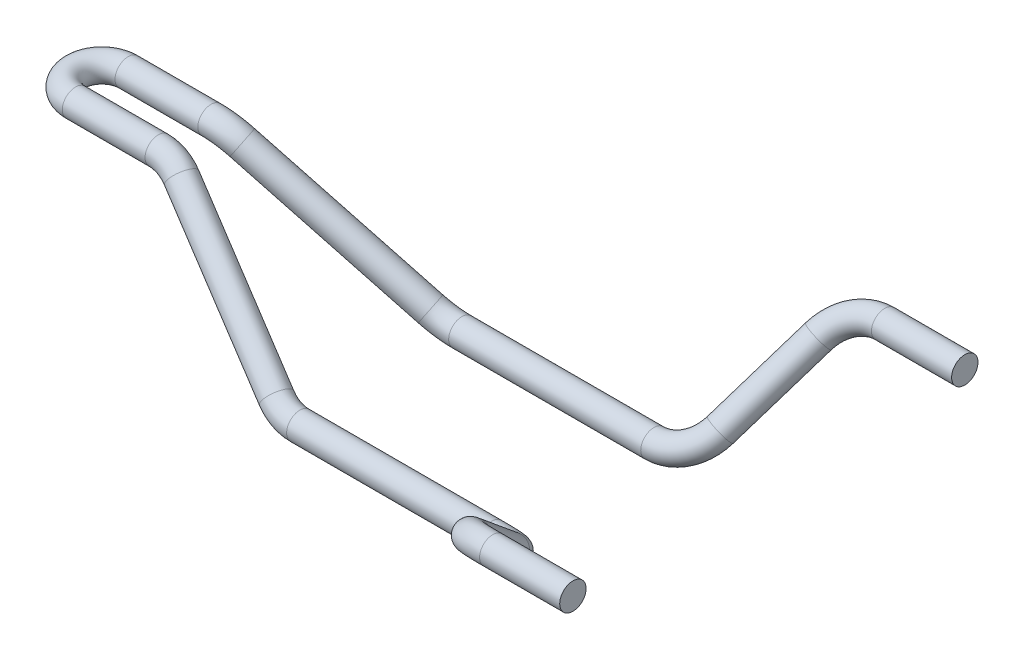
ISO-10303-21;
HEADER;
FILE_DESCRIPTION(('STEP AP214'),'2;1');
FILE_NAME('part.step','',(''),(''),'','','');
FILE_SCHEMA(('AUTOMOTIVE_DESIGN { 1 0 10303 214 1 1 1 1 }'));
ENDSEC;
DATA;
#1=APPLICATION_CONTEXT('core data for automotive mechanical design processes');
#2=APPLICATION_PROTOCOL_DEFINITION('international standard','automotive_design',2000,#1);
#3=PRODUCT_CONTEXT('',#1,'mechanical');
#4=PRODUCT('Part','Part','',(#3));
#5=PRODUCT_RELATED_PRODUCT_CATEGORY('part','',(#4));
#6=PRODUCT_DEFINITION_FORMATION('','',#4);
#7=PRODUCT_DEFINITION_CONTEXT('part definition',#1,'design');
#8=PRODUCT_DEFINITION('design','',#6,#7);
#9=PRODUCT_DEFINITION_SHAPE('','',#8);
#10=(LENGTH_UNIT() NAMED_UNIT(*) SI_UNIT(.MILLI.,.METRE.));
#11=(NAMED_UNIT(*) PLANE_ANGLE_UNIT() SI_UNIT($,.RADIAN.));
#12=(NAMED_UNIT(*) SI_UNIT($,.STERADIAN.) SOLID_ANGLE_UNIT());
#13=UNCERTAINTY_MEASURE_WITH_UNIT(LENGTH_MEASURE(1.E-05),#10,'distance_accuracy_value','');
#14=(GEOMETRIC_REPRESENTATION_CONTEXT(3) GLOBAL_UNCERTAINTY_ASSIGNED_CONTEXT((#13)) GLOBAL_UNIT_ASSIGNED_CONTEXT((#10,
#11,#12)) REPRESENTATION_CONTEXT('',''));
#15=CARTESIAN_POINT('',(0.,0.,0.));
#16=DIRECTION('',(0.,0.,1.));
#17=DIRECTION('',(1.,0.,0.));
#18=AXIS2_PLACEMENT_3D('',#15,#16,#17);
#19=CARTESIAN_POINT('',(155.73421721647,-2.49999999999997,-52.));
#20=DIRECTION('',(1.,0.,0.));
#21=DIRECTION('',(0.,1.,0.));
#22=AXIS2_PLACEMENT_3D('',#19,#20,#21);
#23=CYLINDRICAL_SURFACE('',#22,3.5);
#24=CARTESIAN_POINT('',(155.73421721647,-2.49999999999997,-52.));
#25=DIRECTION('',(-1.,0.,0.));
#26=DIRECTION('',(0.,0.,1.));
#27=AXIS2_PLACEMENT_3D('',#24,#25,#26);
#28=CIRCLE('',#27,3.5);
#29=CARTESIAN_POINT('',(155.73421721647,-0.156270073709799,-54.5994095546127));
#30=VERTEX_POINT('',#29);
#31=EDGE_CURVE('E30',#30,#30,#28,.T.);
#32=ORIENTED_EDGE('',*,*,#31,.F.);
#33=EDGE_LOOP('',(#32));
#34=FACE_BOUND('',#33,.T.);
#35=CARTESIAN_POINT('',(177.,-2.49999999999997,-52.));
#36=DIRECTION('',(-1.,0.,0.));
#37=DIRECTION('',(0.,0.,1.));
#38=AXIS2_PLACEMENT_3D('',#35,#36,#37);
#39=CIRCLE('',#38,3.5);
#40=CARTESIAN_POINT('',(177.,-2.49999999999997,-48.5));
#41=VERTEX_POINT('',#40);
#42=EDGE_CURVE('E10',#41,#41,#39,.T.);
#43=ORIENTED_EDGE('',*,*,#42,.T.);
#44=EDGE_LOOP('',(#43));
#45=FACE_BOUND('',#44,.T.);
#46=ADVANCED_FACE('F24',(#34,#45),#23,.T.);
#47=CARTESIAN_POINT('',(155.73421721647,-10.5356454615663,-43.0877386698992));
#48=DIRECTION('',(0.,-0.742688444175064,-0.669637121797189));
#49=DIRECTION('',(0.,0.669637121797189,-0.742688444175064));
#50=AXIS2_PLACEMENT_3D('',#47,#48,#49);
#51=TOROIDAL_SURFACE('',#50,12.,3.5);
#52=CARTESIAN_POINT('',(144.315206142244,-8.06558420208298,-45.8272611576897));
#53=DIRECTION('',(-0.307388033891904,-0.637216142459563,0.706730630727878));
#54=DIRECTION('',(0.706730630727878,0.344457922664195,0.617964849408802));
#55=AXIS2_PLACEMENT_3D('',#52,#53,#54);
#56=CIRCLE('',#55,3.5);
#57=CARTESIAN_POINT('',(140.984661245595,-7.34514966806703,-46.626288549962));
#58=VERTEX_POINT('',#57);
#59=EDGE_CURVE('E34',#58,#58,#56,.T.);
#60=CARTESIAN_POINT('',(155.73421721647,-10.5356454615663,-43.0877386698992));
#61=DIRECTION('',(0.,-0.742688444175064,-0.669637121797189));
#62=DIRECTION('',(0.,0.669637121797189,-0.742688444175064));
#63=AXIS2_PLACEMENT_3D('',#60,#61,#62);
#64=CIRCLE('',#63,15.5);
#65=EDGE_CURVE('',#58,#30,#64,.T.);
#66=ORIENTED_EDGE('',*,*,#59,.F.);
#67=ORIENTED_EDGE('',*,*,#31,.T.);
#68=ORIENTED_EDGE('',*,*,#65,.T.);
#69=ORIENTED_EDGE('',*,*,#65,.F.);
#70=EDGE_LOOP('',(#66,#68,#67,#69));
#71=FACE_BOUND('',#70,.T.);
#72=ADVANCED_FACE('F117',(#71),#51,.T.);
#73=CARTESIAN_POINT('',(136.419011074226,-24.434415797917,-27.6727388423102));
#74=DIRECTION('',(0.307388033891904,0.637216142459562,-0.706730630727878));
#75=DIRECTION('',(0.,0.742688444175064,0.669637121797189));
#76=AXIS2_PLACEMENT_3D('',#73,#74,#75);
#77=CYLINDRICAL_SURFACE('',#76,3.5);
#78=CARTESIAN_POINT('',(136.419011074226,-24.434415797917,-27.6727388423102));
#79=DIRECTION('',(-0.307388033891904,-0.637216142459563,0.706730630727878));
#80=DIRECTION('',(0.706730630727878,0.344457922664195,0.617964849408802));
#81=AXIS2_PLACEMENT_3D('',#78,#79,#80);
#82=CIRCLE('',#81,3.5);
#83=CARTESIAN_POINT('',(139.749555970875,-25.1548503319329,-26.873711450038));
#84=VERTEX_POINT('',#83);
#85=EDGE_CURVE('E38',#84,#84,#82,.T.);
#86=ORIENTED_EDGE('',*,*,#85,.F.);
#87=EDGE_LOOP('',(#86));
#88=FACE_BOUND('',#87,.T.);
#89=ORIENTED_EDGE('',*,*,#59,.T.);
#90=EDGE_LOOP('',(#89));
#91=FACE_BOUND('',#90,.T.);
#92=ADVANCED_FACE('F122',(#88,#91),#77,.T.);
#93=CARTESIAN_POINT('',(125.,-21.9643545384337,-30.4122613301008));
#94=DIRECTION('',(0.,0.742688444175064,0.669637121797189));
#95=DIRECTION('',(0.,-0.669637121797189,0.742688444175064));
#96=AXIS2_PLACEMENT_3D('',#93,#94,#95);
#97=TOROIDAL_SURFACE('',#96,12.,3.5);
#98=CARTESIAN_POINT('',(125.,-30.,-21.5));
#99=DIRECTION('',(-1.,0.,0.));
#100=DIRECTION('',(0.,0.,1.));
#101=AXIS2_PLACEMENT_3D('',#98,#99,#100);
#102=CIRCLE('',#101,3.5);
#103=CARTESIAN_POINT('',(125.,-32.3437299262902,-18.9005904453873));
#104=VERTEX_POINT('',#103);
#105=EDGE_CURVE('E43',#104,#104,#102,.T.);
#106=CARTESIAN_POINT('',(125.,-21.9643545384337,-30.4122613301008));
#107=DIRECTION('',(0.,0.742688444175064,0.669637121797189));
#108=DIRECTION('',(0.,-0.669637121797189,0.742688444175064));
#109=AXIS2_PLACEMENT_3D('',#106,#107,#108);
#110=CIRCLE('',#109,15.5);
#111=EDGE_CURVE('',#104,#84,#110,.T.);
#112=ORIENTED_EDGE('',*,*,#105,.F.);
#113=ORIENTED_EDGE('',*,*,#85,.T.);
#114=ORIENTED_EDGE('',*,*,#111,.T.);
#115=ORIENTED_EDGE('',*,*,#111,.F.);
#116=EDGE_LOOP('',(#112,#114,#113,#115));
#117=FACE_BOUND('',#116,.T.);
#118=ADVANCED_FACE('F127',(#117),#97,.T.);
#119=CARTESIAN_POINT('',(74.0309860559005,-30.,-21.5));
#120=DIRECTION('',(1.,0.,0.));
#121=DIRECTION('',(0.,0.,-1.));
#122=AXIS2_PLACEMENT_3D('',#119,#120,#121);
#123=CYLINDRICAL_SURFACE('',#122,3.5);
#124=CARTESIAN_POINT('',(74.0309860559005,-30.,-21.5));
#125=DIRECTION('',(-1.,0.,0.));
#126=DIRECTION('',(0.,0.,1.));
#127=AXIS2_PLACEMENT_3D('',#124,#125,#126);
#128=CIRCLE('',#127,3.5);
#129=CARTESIAN_POINT('',(74.0309860559005,-33.1512213349468,-23.023090311891));
#130=VERTEX_POINT('',#129);
#131=EDGE_CURVE('E46',#130,#130,#128,.T.);
#132=ORIENTED_EDGE('',*,*,#131,.F.);
#133=EDGE_LOOP('',(#132));
#134=FACE_BOUND('',#133,.T.);
#135=ORIENTED_EDGE('',*,*,#105,.T.);
#136=EDGE_LOOP('',(#135));
#137=FACE_BOUND('',#136,.T.);
#138=ADVANCED_FACE('F134',(#134,#137),#123,.T.);
#139=CARTESIAN_POINT('',(74.0309860559005,-19.1958125658967,-16.2779760735167));
#140=DIRECTION('',(0.,-0.435168660540273,0.900348952841944));
#141=DIRECTION('',(0.,-0.900348952841944,-0.435168660540273));
#142=AXIS2_PLACEMENT_3D('',#139,#140,#141);
#143=TOROIDAL_SURFACE('',#142,12.,3.5);
#144=CARTESIAN_POINT('',(66.7864785641725,-27.8089626573903,-20.4409986177387));
#145=DIRECTION('',(-0.797204800826234,0.543548727836077,0.262715218454104));
#146=DIRECTION('',(0.262715218454104,-0.0794558987980981,0.961596315580919));
#147=AXIS2_PLACEMENT_3D('',#144,#145,#146);
#148=CIRCLE('',#147,3.5);
#149=CARTESIAN_POINT('',(64.6734972124185,-30.321131434076,-21.65521352647));
#150=VERTEX_POINT('',#149);
#151=EDGE_CURVE('E49',#150,#150,#148,.T.);
#152=CARTESIAN_POINT('',(74.0309860559005,-19.1958125658967,-16.2779760735167));
#153=DIRECTION('',(0.,-0.435168660540273,0.900348952841944));
#154=DIRECTION('',(0.,-0.900348952841944,-0.435168660540273));
#155=AXIS2_PLACEMENT_3D('',#152,#153,#154);
#156=CIRCLE('',#155,15.5);
#157=EDGE_CURVE('',#150,#130,#156,.T.);
#158=ORIENTED_EDGE('',*,*,#151,.F.);
#159=ORIENTED_EDGE('',*,*,#131,.T.);
#160=ORIENTED_EDGE('',*,*,#157,.T.);
#161=ORIENTED_EDGE('',*,*,#157,.F.);
#162=EDGE_LOOP('',(#158,#160,#159,#161));
#163=FACE_BOUND('',#162,.T.);
#164=ADVANCED_FACE('F138',(#163),#143,.T.);
#165=CARTESIAN_POINT('',(29.2135214358275,-2.19103734260966,-8.05900138226133));
#166=DIRECTION('',(0.797204800826238,-0.543548727836071,-0.262715218454101));
#167=DIRECTION('',(0.56333682464151,0.826227342807548,0.));
#168=AXIS2_PLACEMENT_3D('',#165,#166,#167);
#169=CYLINDRICAL_SURFACE('',#168,3.5);
#170=CARTESIAN_POINT('',(29.2135214358275,-2.19103734260966,-8.05900138226133));
#171=DIRECTION('',(-0.797204800826234,0.543548727836077,0.262715218454104));
#172=DIRECTION('',(0.262715218454104,-0.0794558987980981,0.961596315580919));
#173=AXIS2_PLACEMENT_3D('',#170,#171,#172);
#174=CIRCLE('',#173,3.5);
#175=CARTESIAN_POINT('',(31.3265027875815,0.321131434075993,-6.84478647352993));
#176=VERTEX_POINT('',#175);
#177=EDGE_CURVE('E52',#176,#176,#174,.T.);
#178=ORIENTED_EDGE('',*,*,#177,.F.);
#179=EDGE_LOOP('',(#178));
#180=FACE_BOUND('',#179,.T.);
#181=ORIENTED_EDGE('',*,*,#151,.T.);
#182=EDGE_LOOP('',(#181));
#183=FACE_BOUND('',#182,.T.);
#184=ADVANCED_FACE('F142',(#180,#183),#169,.T.);
#185=CARTESIAN_POINT('',(21.9690139440995,-10.8041874341033,-12.2220239264833));
#186=DIRECTION('',(0.,0.435168660540273,-0.900348952841944));
#187=DIRECTION('',(0.,0.900348952841944,0.435168660540273));
#188=AXIS2_PLACEMENT_3D('',#185,#186,#187);
#189=TOROIDAL_SURFACE('',#188,12.,3.5);
#190=CARTESIAN_POINT('',(21.9690139440995,0.,-7.));
#191=DIRECTION('',(-1.,0.,0.));
#192=DIRECTION('',(0.,0.,1.));
#193=AXIS2_PLACEMENT_3D('',#190,#191,#192);
#194=CIRCLE('',#193,3.5);
#195=CARTESIAN_POINT('',(21.9690139440995,3.1512213349468,-5.47690968810904));
#196=VERTEX_POINT('',#195);
#197=EDGE_CURVE('E55',#196,#196,#194,.T.);
#198=CARTESIAN_POINT('',(21.9690139440995,-10.8041874341033,-12.2220239264833));
#199=DIRECTION('',(0.,0.435168660540273,-0.900348952841944));
#200=DIRECTION('',(0.,0.900348952841944,0.435168660540273));
#201=AXIS2_PLACEMENT_3D('',#198,#199,#200);
#202=CIRCLE('',#201,15.5);
#203=EDGE_CURVE('',#196,#176,#202,.T.);
#204=ORIENTED_EDGE('',*,*,#197,.F.);
#205=ORIENTED_EDGE('',*,*,#177,.T.);
#206=ORIENTED_EDGE('',*,*,#203,.T.);
#207=ORIENTED_EDGE('',*,*,#203,.F.);
#208=EDGE_LOOP('',(#204,#206,#205,#207));
#209=FACE_BOUND('',#208,.T.);
#210=ADVANCED_FACE('F110',(#209),#189,.T.);
#211=CARTESIAN_POINT('',(0.,0.,-7.));
#212=DIRECTION('',(1.,0.,0.));
#213=DIRECTION('',(0.,0.,-1.));
#214=AXIS2_PLACEMENT_3D('',#211,#212,#213);
#215=CYLINDRICAL_SURFACE('',#214,3.5);
#216=CARTESIAN_POINT('',(0.,0.,-7.));
#217=DIRECTION('',(-1.,0.,0.));
#218=DIRECTION('',(0.,0.,1.));
#219=AXIS2_PLACEMENT_3D('',#216,#217,#218);
#220=CIRCLE('',#219,3.5);
#221=CARTESIAN_POINT('',(0.,0.,-10.5));
#222=VERTEX_POINT('',#221);
#223=EDGE_CURVE('E58',#222,#222,#220,.T.);
#224=ORIENTED_EDGE('',*,*,#223,.F.);
#225=EDGE_LOOP('',(#224));
#226=FACE_BOUND('',#225,.T.);
#227=ORIENTED_EDGE('',*,*,#197,.T.);
#228=EDGE_LOOP('',(#227));
#229=FACE_BOUND('',#228,.T.);
#230=ADVANCED_FACE('F98',(#226,#229),#215,.T.);
#231=CARTESIAN_POINT('',(0.,0.,0.));
#232=DIRECTION('',(0.,1.,0.));
#233=DIRECTION('',(0.,0.,1.));
#234=AXIS2_PLACEMENT_3D('',#231,#232,#233);
#235=TOROIDAL_SURFACE('',#234,7.,3.5);
#236=CARTESIAN_POINT('',(0.,0.,7.));
#237=DIRECTION('',(1.,0.,0.));
#238=DIRECTION('',(0.,0.,-1.));
#239=AXIS2_PLACEMENT_3D('',#236,#237,#238);
#240=CIRCLE('',#239,3.5);
#241=CARTESIAN_POINT('',(0.,0.,10.5));
#242=VERTEX_POINT('',#241);
#243=EDGE_CURVE('E88',#242,#242,#240,.T.);
#244=CARTESIAN_POINT('',(0.,0.,0.));
#245=DIRECTION('',(0.,1.,0.));
#246=DIRECTION('',(0.,0.,1.));
#247=AXIS2_PLACEMENT_3D('',#244,#245,#246);
#248=CIRCLE('',#247,10.5);
#249=EDGE_CURVE('',#222,#242,#248,.T.);
#250=ORIENTED_EDGE('',*,*,#223,.T.);
#251=ORIENTED_EDGE('',*,*,#243,.F.);
#252=ORIENTED_EDGE('',*,*,#249,.T.);
#253=ORIENTED_EDGE('',*,*,#249,.F.);
#254=EDGE_LOOP('',(#250,#252,#251,#253));
#255=FACE_BOUND('',#254,.T.);
#256=ADVANCED_FACE('F95',(#255),#235,.T.);
#257=CARTESIAN_POINT('',(177.,-2.49999999999997,-52.));
#258=DIRECTION('',(-1.,0.,0.));
#259=DIRECTION('',(0.,0.,1.));
#260=AXIS2_PLACEMENT_3D('',#257,#258,#259);
#261=PLANE('',#260);
#262=ORIENTED_EDGE('',*,*,#42,.F.);
#263=EDGE_LOOP('',(#262));
#264=FACE_BOUND('',#263,.T.);
#265=ADVANCED_FACE('F97',(#264),#261,.F.);
#266=CARTESIAN_POINT('',(155.73421721647,-2.49999999999997,52.));
#267=DIRECTION('',(1.,0.,0.));
#268=DIRECTION('',(0.,1.,0.));
#269=AXIS2_PLACEMENT_3D('',#266,#267,#268);
#270=CYLINDRICAL_SURFACE('',#269,3.5);
#271=CARTESIAN_POINT('',(155.73421721647,-2.49999999999997,52.));
#272=DIRECTION('',(1.,0.,0.));
#273=DIRECTION('',(0.,0.,-1.));
#274=AXIS2_PLACEMENT_3D('',#271,#272,#273);
#275=CIRCLE('',#274,3.5);
#276=CARTESIAN_POINT('',(155.73421721647,-0.156270073709799,54.5994095546127));
#277=VERTEX_POINT('',#276);
#278=EDGE_CURVE('E64',#277,#277,#275,.T.);
#279=ORIENTED_EDGE('',*,*,#278,.T.);
#280=EDGE_LOOP('',(#279));
#281=FACE_BOUND('',#280,.T.);
#282=CARTESIAN_POINT('',(177.,-2.49999999999997,52.));
#283=DIRECTION('',(1.,0.,0.));
#284=DIRECTION('',(0.,0.,-1.));
#285=AXIS2_PLACEMENT_3D('',#282,#283,#284);
#286=CIRCLE('',#285,3.5);
#287=CARTESIAN_POINT('',(177.,-2.49999999999997,48.5));
#288=VERTEX_POINT('',#287);
#289=EDGE_CURVE('E61',#288,#288,#286,.T.);
#290=ORIENTED_EDGE('',*,*,#289,.F.);
#291=EDGE_LOOP('',(#290));
#292=FACE_BOUND('',#291,.T.);
#293=ADVANCED_FACE('F101',(#281,#292),#270,.T.);
#294=CARTESIAN_POINT('',(155.73421721647,-10.5356454615663,43.0877386698992));
#295=DIRECTION('',(0.,0.742688444175064,-0.669637121797189));
#296=DIRECTION('',(0.,0.669637121797189,0.742688444175064));
#297=AXIS2_PLACEMENT_3D('',#294,#295,#296);
#298=TOROIDAL_SURFACE('',#297,12.,3.5);
#299=CARTESIAN_POINT('',(144.315206142244,-8.06558420208298,45.8272611576897));
#300=DIRECTION('',(0.307388033891904,0.637216142459563,0.706730630727878));
#301=DIRECTION('',(0.706730630727878,0.344457922664195,-0.617964849408802));
#302=AXIS2_PLACEMENT_3D('',#299,#300,#301);
#303=CIRCLE('',#302,3.5);
#304=CARTESIAN_POINT('',(140.984661245595,-7.34514966806703,46.626288549962));
#305=VERTEX_POINT('',#304);
#306=EDGE_CURVE('E67',#305,#305,#303,.T.);
#307=CARTESIAN_POINT('',(155.73421721647,-10.5356454615663,43.0877386698992));
#308=DIRECTION('',(0.,0.742688444175064,-0.669637121797189));
#309=DIRECTION('',(0.,0.669637121797189,0.742688444175064));
#310=AXIS2_PLACEMENT_3D('',#307,#308,#309);
#311=CIRCLE('',#310,15.5);
#312=EDGE_CURVE('',#305,#277,#311,.T.);
#313=ORIENTED_EDGE('',*,*,#306,.T.);
#314=ORIENTED_EDGE('',*,*,#278,.F.);
#315=ORIENTED_EDGE('',*,*,#312,.T.);
#316=ORIENTED_EDGE('',*,*,#312,.F.);
#317=EDGE_LOOP('',(#313,#315,#314,#316));
#318=FACE_BOUND('',#317,.T.);
#319=ADVANCED_FACE('F113',(#318),#298,.T.);
#320=CARTESIAN_POINT('',(136.419011074226,-24.434415797917,27.6727388423102));
#321=DIRECTION('',(0.307388033891904,0.637216142459562,0.706730630727878));
#322=DIRECTION('',(0.,-0.742688444175064,0.669637121797189));
#323=AXIS2_PLACEMENT_3D('',#320,#321,#322);
#324=CYLINDRICAL_SURFACE('',#323,3.5);
#325=CARTESIAN_POINT('',(136.419011074226,-24.434415797917,27.6727388423102));
#326=DIRECTION('',(0.307388033891904,0.637216142459563,0.706730630727878));
#327=DIRECTION('',(0.706730630727878,0.344457922664195,-0.617964849408802));
#328=AXIS2_PLACEMENT_3D('',#325,#326,#327);
#329=CIRCLE('',#328,3.5);
#330=CARTESIAN_POINT('',(139.749555970875,-25.1548503319329,26.873711450038));
#331=VERTEX_POINT('',#330);
#332=EDGE_CURVE('E70',#331,#331,#329,.T.);
#333=ORIENTED_EDGE('',*,*,#332,.T.);
#334=EDGE_LOOP('',(#333));
#335=FACE_BOUND('',#334,.T.);
#336=ORIENTED_EDGE('',*,*,#306,.F.);
#337=EDGE_LOOP('',(#336));
#338=FACE_BOUND('',#337,.T.);
#339=ADVANCED_FACE('F183',(#335,#338),#324,.T.);
#340=CARTESIAN_POINT('',(125.,-21.9643545384337,30.4122613301008));
#341=DIRECTION('',(0.,-0.742688444175064,0.669637121797189));
#342=DIRECTION('',(0.,-0.669637121797189,-0.742688444175064));
#343=AXIS2_PLACEMENT_3D('',#340,#341,#342);
#344=TOROIDAL_SURFACE('',#343,12.,3.5);
#345=CARTESIAN_POINT('',(125.,-30.,21.5));
#346=DIRECTION('',(1.,0.,0.));
#347=DIRECTION('',(0.,0.,-1.));
#348=AXIS2_PLACEMENT_3D('',#345,#346,#347);
#349=CIRCLE('',#348,3.5);
#350=CARTESIAN_POINT('',(125.,-32.3437299262902,18.9005904453873));
#351=VERTEX_POINT('',#350);
#352=EDGE_CURVE('E73',#351,#351,#349,.T.);
#353=CARTESIAN_POINT('',(125.,-21.9643545384337,30.4122613301008));
#354=DIRECTION('',(0.,-0.742688444175064,0.669637121797189));
#355=DIRECTION('',(0.,-0.669637121797189,-0.742688444175064));
#356=AXIS2_PLACEMENT_3D('',#353,#354,#355);
#357=CIRCLE('',#356,15.5);
#358=EDGE_CURVE('',#351,#331,#357,.T.);
#359=ORIENTED_EDGE('',*,*,#352,.T.);
#360=ORIENTED_EDGE('',*,*,#332,.F.);
#361=ORIENTED_EDGE('',*,*,#358,.T.);
#362=ORIENTED_EDGE('',*,*,#358,.F.);
#363=EDGE_LOOP('',(#359,#361,#360,#362));
#364=FACE_BOUND('',#363,.T.);
#365=ADVANCED_FACE('F190',(#364),#344,.T.);
#366=CARTESIAN_POINT('',(74.0309860559005,-30.,21.5));
#367=DIRECTION('',(1.,0.,0.));
#368=DIRECTION('',(0.,0.,-1.));
#369=AXIS2_PLACEMENT_3D('',#366,#367,#368);
#370=CYLINDRICAL_SURFACE('',#369,3.5);
#371=CARTESIAN_POINT('',(74.0309860559005,-30.,21.5));
#372=DIRECTION('',(1.,0.,0.));
#373=DIRECTION('',(0.,0.,-1.));
#374=AXIS2_PLACEMENT_3D('',#371,#372,#373);
#375=CIRCLE('',#374,3.5);
#376=CARTESIAN_POINT('',(74.0309860559005,-33.1512213349468,23.023090311891));
#377=VERTEX_POINT('',#376);
#378=EDGE_CURVE('E76',#377,#377,#375,.T.);
#379=ORIENTED_EDGE('',*,*,#378,.T.);
#380=EDGE_LOOP('',(#379));
#381=FACE_BOUND('',#380,.T.);
#382=ORIENTED_EDGE('',*,*,#352,.F.);
#383=EDGE_LOOP('',(#382));
#384=FACE_BOUND('',#383,.T.);
#385=ADVANCED_FACE('F194',(#381,#384),#370,.T.);
#386=CARTESIAN_POINT('',(74.0309860559005,-19.1958125658967,16.2779760735167));
#387=DIRECTION('',(0.,0.435168660540273,0.900348952841944));
#388=DIRECTION('',(0.,-0.900348952841944,0.435168660540273));
#389=AXIS2_PLACEMENT_3D('',#386,#387,#388);
#390=TOROIDAL_SURFACE('',#389,12.,3.5);
#391=CARTESIAN_POINT('',(66.7864785641725,-27.8089626573903,20.4409986177387));
#392=DIRECTION('',(0.797204800826234,-0.543548727836077,0.262715218454104));
#393=DIRECTION('',(0.262715218454104,-0.0794558987980981,-0.961596315580919));
#394=AXIS2_PLACEMENT_3D('',#391,#392,#393);
#395=CIRCLE('',#394,3.5);
#396=CARTESIAN_POINT('',(64.6734972124185,-30.321131434076,21.65521352647));
#397=VERTEX_POINT('',#396);
#398=EDGE_CURVE('E79',#397,#397,#395,.T.);
#399=CARTESIAN_POINT('',(74.0309860559005,-19.1958125658967,16.2779760735167));
#400=DIRECTION('',(0.,0.435168660540273,0.900348952841944));
#401=DIRECTION('',(0.,-0.900348952841944,0.435168660540273));
#402=AXIS2_PLACEMENT_3D('',#399,#400,#401);
#403=CIRCLE('',#402,15.5);
#404=EDGE_CURVE('',#397,#377,#403,.T.);
#405=ORIENTED_EDGE('',*,*,#398,.T.);
#406=ORIENTED_EDGE('',*,*,#378,.F.);
#407=ORIENTED_EDGE('',*,*,#404,.T.);
#408=ORIENTED_EDGE('',*,*,#404,.F.);
#409=EDGE_LOOP('',(#405,#407,#406,#408));
#410=FACE_BOUND('',#409,.T.);
#411=ADVANCED_FACE('F198',(#410),#390,.T.);
#412=CARTESIAN_POINT('',(29.2135214358275,-2.19103734260966,8.05900138226133));
#413=DIRECTION('',(0.797204800826238,-0.543548727836071,0.262715218454101));
#414=DIRECTION('',(0.56333682464151,0.826227342807548,0.));
#415=AXIS2_PLACEMENT_3D('',#412,#413,#414);
#416=CYLINDRICAL_SURFACE('',#415,3.5);
#417=CARTESIAN_POINT('',(29.2135214358275,-2.19103734260966,8.05900138226133));
#418=DIRECTION('',(0.797204800826234,-0.543548727836077,0.262715218454104));
#419=DIRECTION('',(0.262715218454104,-0.0794558987980981,-0.961596315580919));
#420=AXIS2_PLACEMENT_3D('',#417,#418,#419);
#421=CIRCLE('',#420,3.5);
#422=CARTESIAN_POINT('',(31.3265027875815,0.321131434075993,6.84478647352993));
#423=VERTEX_POINT('',#422);
#424=EDGE_CURVE('E82',#423,#423,#421,.T.);
#425=ORIENTED_EDGE('',*,*,#424,.T.);
#426=EDGE_LOOP('',(#425));
#427=FACE_BOUND('',#426,.T.);
#428=ORIENTED_EDGE('',*,*,#398,.F.);
#429=EDGE_LOOP('',(#428));
#430=FACE_BOUND('',#429,.T.);
#431=ADVANCED_FACE('F202',(#427,#430),#416,.T.);
#432=CARTESIAN_POINT('',(21.9690139440995,-10.8041874341033,12.2220239264833));
#433=DIRECTION('',(0.,-0.435168660540273,-0.900348952841944));
#434=DIRECTION('',(0.,0.900348952841944,-0.435168660540273));
#435=AXIS2_PLACEMENT_3D('',#432,#433,#434);
#436=TOROIDAL_SURFACE('',#435,12.,3.5);
#437=CARTESIAN_POINT('',(21.9690139440995,0.,7.));
#438=DIRECTION('',(1.,0.,0.));
#439=DIRECTION('',(0.,0.,-1.));
#440=AXIS2_PLACEMENT_3D('',#437,#438,#439);
#441=CIRCLE('',#440,3.5);
#442=CARTESIAN_POINT('',(21.9690139440995,3.1512213349468,5.47690968810904));
#443=VERTEX_POINT('',#442);
#444=EDGE_CURVE('E85',#443,#443,#441,.T.);
#445=CARTESIAN_POINT('',(21.9690139440995,-10.8041874341033,12.2220239264833));
#446=DIRECTION('',(0.,-0.435168660540273,-0.900348952841944));
#447=DIRECTION('',(0.,0.900348952841944,-0.435168660540273));
#448=AXIS2_PLACEMENT_3D('',#445,#446,#447);
#449=CIRCLE('',#448,15.5);
#450=EDGE_CURVE('',#443,#423,#449,.T.);
#451=ORIENTED_EDGE('',*,*,#444,.T.);
#452=ORIENTED_EDGE('',*,*,#424,.F.);
#453=ORIENTED_EDGE('',*,*,#450,.T.);
#454=ORIENTED_EDGE('',*,*,#450,.F.);
#455=EDGE_LOOP('',(#451,#453,#452,#454));
#456=FACE_BOUND('',#455,.T.);
#457=ADVANCED_FACE('F206',(#456),#436,.T.);
#458=CARTESIAN_POINT('',(0.,0.,7.));
#459=DIRECTION('',(1.,0.,0.));
#460=DIRECTION('',(0.,0.,-1.));
#461=AXIS2_PLACEMENT_3D('',#458,#459,#460);
#462=CYLINDRICAL_SURFACE('',#461,3.5);
#463=ORIENTED_EDGE('',*,*,#243,.T.);
#464=EDGE_LOOP('',(#463));
#465=FACE_BOUND('',#464,.T.);
#466=ORIENTED_EDGE('',*,*,#444,.F.);
#467=EDGE_LOOP('',(#466));
#468=FACE_BOUND('',#467,.T.);
#469=ADVANCED_FACE('F92',(#465,#468),#462,.T.);
#470=CARTESIAN_POINT('',(177.,-2.49999999999997,52.));
#471=DIRECTION('',(-1.,0.,0.));
#472=DIRECTION('',(0.,0.,-1.));
#473=AXIS2_PLACEMENT_3D('',#470,#471,#472);
#474=PLANE('',#473);
#475=ORIENTED_EDGE('',*,*,#289,.T.);
#476=EDGE_LOOP('',(#475));
#477=FACE_BOUND('',#476,.T.);
#478=ADVANCED_FACE('F213',(#477),#474,.F.);
#479=CLOSED_SHELL('',(#46,#72,#92,#118,#138,#164,#184,#210,#230,#256,#265,#293,#319,#339,#365,
#385,#411,#431,#457,#469,#478));
#480=MANIFOLD_SOLID_BREP('B2',#479);
#481=ADVANCED_BREP_SHAPE_REPRESENTATION('',(#18,#480),#14);
#482=SHAPE_DEFINITION_REPRESENTATION(#9,#481);
ENDSEC;
END-ISO-10303-21;
